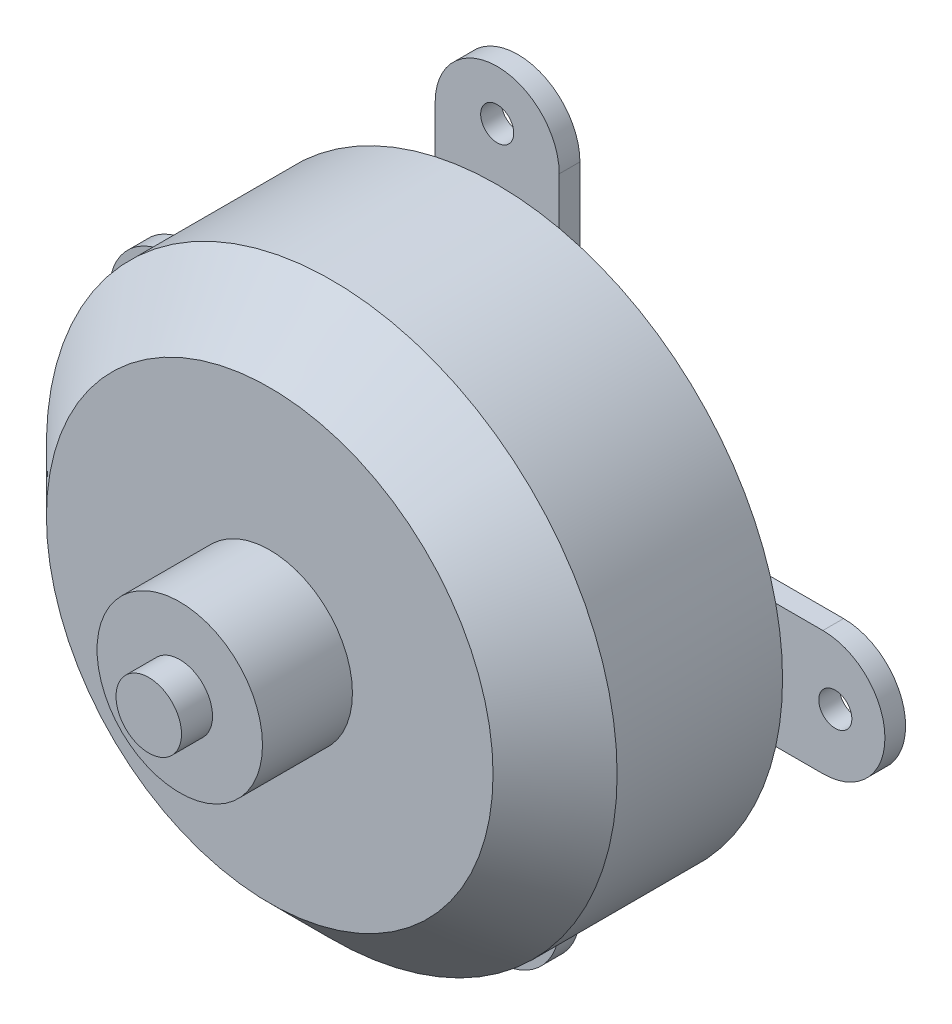
ISO-10303-21;
HEADER;
FILE_DESCRIPTION(('STEP AP214'),'2;1');
FILE_NAME('part.step','',(''),(''),'','','');
FILE_SCHEMA(('AUTOMOTIVE_DESIGN { 1 0 10303 214 1 1 1 1 }'));
ENDSEC;
DATA;
#1=APPLICATION_CONTEXT('core data for automotive mechanical design processes');
#2=APPLICATION_PROTOCOL_DEFINITION('international standard','automotive_design',2000,#1);
#3=PRODUCT_CONTEXT('',#1,'mechanical');
#4=PRODUCT('Part','Part','',(#3));
#5=PRODUCT_RELATED_PRODUCT_CATEGORY('part','',(#4));
#6=PRODUCT_DEFINITION_FORMATION('','',#4);
#7=PRODUCT_DEFINITION_CONTEXT('part definition',#1,'design');
#8=PRODUCT_DEFINITION('design','',#6,#7);
#9=PRODUCT_DEFINITION_SHAPE('','',#8);
#10=(LENGTH_UNIT() NAMED_UNIT(*) SI_UNIT(.MILLI.,.METRE.));
#11=(NAMED_UNIT(*) PLANE_ANGLE_UNIT() SI_UNIT($,.RADIAN.));
#12=(NAMED_UNIT(*) SI_UNIT($,.STERADIAN.) SOLID_ANGLE_UNIT());
#13=UNCERTAINTY_MEASURE_WITH_UNIT(LENGTH_MEASURE(1.E-05),#10,'distance_accuracy_value','');
#14=(GEOMETRIC_REPRESENTATION_CONTEXT(3) GLOBAL_UNCERTAINTY_ASSIGNED_CONTEXT((#13)) GLOBAL_UNIT_ASSIGNED_CONTEXT((#10,
#11,#12)) REPRESENTATION_CONTEXT('',''));
#15=CARTESIAN_POINT('',(0.,0.,0.));
#16=DIRECTION('',(0.,0.,1.));
#17=DIRECTION('',(1.,0.,0.));
#18=AXIS2_PLACEMENT_3D('',#15,#16,#17);
#19=CARTESIAN_POINT('',(-41.6387437653,8.21187680793408,16.35));
#20=DIRECTION('',(0.,0.,1.));
#21=DIRECTION('',(1.,0.,0.));
#22=AXIS2_PLACEMENT_3D('',#19,#20,#21);
#23=PLANE('',#22);
#24=CARTESIAN_POINT('',(-41.6387437653,8.21187680793408,16.35));
#25=DIRECTION('',(0.,0.,1.));
#26=DIRECTION('',(1.,0.,0.));
#27=AXIS2_PLACEMENT_3D('',#24,#25,#26);
#28=CIRCLE('',#27,4.00000000000001);
#29=CARTESIAN_POINT('',(-37.6387437653,8.21187680793408,16.35));
#30=VERTEX_POINT('',#29);
#31=EDGE_CURVE('E191',#30,#30,#28,.T.);
#32=ORIENTED_EDGE('',*,*,#31,.T.);
#33=EDGE_LOOP('',(#32));
#34=FACE_BOUND('',#33,.T.);
#35=CARTESIAN_POINT('',(-41.6387437653,8.21187680793408,16.35));
#36=DIRECTION('',(0.,0.,1.));
#37=DIRECTION('',(1.,0.,0.));
#38=AXIS2_PLACEMENT_3D('',#35,#36,#37);
#39=CIRCLE('',#38,1.58345957302733);
#40=CARTESIAN_POINT('',(-40.0552841922727,8.21187680793408,16.35));
#41=VERTEX_POINT('',#40);
#42=EDGE_CURVE('E201',#41,#41,#39,.T.);
#43=ORIENTED_EDGE('',*,*,#42,.F.);
#44=EDGE_LOOP('',(#43));
#45=FACE_BOUND('',#44,.T.);
#46=ADVANCED_FACE('F34',(#34,#45),#23,.T.);
#47=CARTESIAN_POINT('',(-41.6387437653,8.21187680793408,12.));
#48=DIRECTION('',(0.,0.,1.));
#49=DIRECTION('',(1.,0.,0.));
#50=AXIS2_PLACEMENT_3D('',#47,#48,#49);
#51=PLANE('',#50);
#52=CARTESIAN_POINT('',(-41.6387437653,8.21187680793408,12.));
#53=DIRECTION('',(0.,0.,1.));
#54=DIRECTION('',(1.,0.,0.));
#55=AXIS2_PLACEMENT_3D('',#52,#53,#54);
#56=CIRCLE('',#55,10.8);
#57=CARTESIAN_POINT('',(-30.8387437653,8.21187680793408,12.));
#58=VERTEX_POINT('',#57);
#59=EDGE_CURVE('E42',#58,#58,#56,.T.);
#60=ORIENTED_EDGE('',*,*,#59,.T.);
#61=EDGE_LOOP('',(#60));
#62=FACE_BOUND('',#61,.T.);
#63=CARTESIAN_POINT('',(-41.6387437653,8.21187680793408,12.));
#64=DIRECTION('',(0.,0.,1.));
#65=DIRECTION('',(1.,0.,0.));
#66=AXIS2_PLACEMENT_3D('',#63,#64,#65);
#67=CIRCLE('',#66,4.00000000000001);
#68=CARTESIAN_POINT('',(-37.6387437653,8.21187680793408,12.));
#69=VERTEX_POINT('',#68);
#70=EDGE_CURVE('E194',#69,#69,#67,.T.);
#71=ORIENTED_EDGE('',*,*,#70,.F.);
#72=EDGE_LOOP('',(#71));
#73=FACE_BOUND('',#72,.T.);
#74=ADVANCED_FACE('F217',(#62,#73),#51,.T.);
#75=CARTESIAN_POINT('',(-38.6387437653,23.9618768079341,1.));
#76=DIRECTION('',(0.,0.,1.));
#77=DIRECTION('',(1.,0.,0.));
#78=AXIS2_PLACEMENT_3D('',#75,#76,#77);
#79=PLANE('',#78);
#80=CARTESIAN_POINT('',(-41.6387437653,8.21187680793408,1.));
#81=DIRECTION('',(0.,0.,1.));
#82=DIRECTION('',(1.,0.,0.));
#83=AXIS2_PLACEMENT_3D('',#80,#81,#82);
#84=CIRCLE('',#83,13.8);
#85=CARTESIAN_POINT('',(-38.6387437653,21.6818434003203,1.));
#86=VERTEX_POINT('',#85);
#87=CARTESIAN_POINT('',(-44.6387437653,21.6818434003203,1.));
#88=VERTEX_POINT('',#87);
#89=EDGE_CURVE('E56',#86,#88,#84,.T.);
#90=ORIENTED_EDGE('',*,*,#89,.F.);
#91=DIRECTION('',(0.,1.,0.));
#92=VECTOR('',#91,1.);
#93=CARTESIAN_POINT('',(-38.6387437653,11.2118768079341,1.));
#94=LINE('',#93,#92);
#95=CARTESIAN_POINT('',(-38.6387437653,23.9618768079341,1.));
#96=VERTEX_POINT('',#95);
#97=EDGE_CURVE('E158',#86,#96,#94,.T.);
#98=ORIENTED_EDGE('',*,*,#97,.T.);
#99=CARTESIAN_POINT('',(-41.6387437653,23.9618768079341,1.));
#100=DIRECTION('',(0.,0.,1.));
#101=DIRECTION('',(1.,0.,0.));
#102=AXIS2_PLACEMENT_3D('',#99,#100,#101);
#103=CIRCLE('',#102,3.);
#104=CARTESIAN_POINT('',(-44.6387437653,23.9618768079341,1.));
#105=VERTEX_POINT('',#104);
#106=EDGE_CURVE('E421',#96,#105,#103,.T.);
#107=ORIENTED_EDGE('',*,*,#106,.T.);
#108=DIRECTION('',(0.,-1.,0.));
#109=VECTOR('',#108,1.);
#110=CARTESIAN_POINT('',(-44.6387437653,23.9618768079341,1.));
#111=LINE('',#110,#109);
#112=EDGE_CURVE('E429',#105,#88,#111,.T.);
#113=ORIENTED_EDGE('',*,*,#112,.T.);
#114=EDGE_LOOP('',(#90,#98,#107,#113));
#115=FACE_BOUND('',#114,.T.);
#116=CARTESIAN_POINT('',(-41.6387437653,24.5618768079341,1.));
#117=DIRECTION('',(0.,0.,1.));
#118=DIRECTION('',(1.,0.,0.));
#119=AXIS2_PLACEMENT_3D('',#116,#117,#118);
#120=CIRCLE('',#119,0.799999999999988);
#121=CARTESIAN_POINT('',(-40.8387437653,24.5618768079341,1.));
#122=VERTEX_POINT('',#121);
#123=EDGE_CURVE('E183',#122,#122,#120,.T.);
#124=ORIENTED_EDGE('',*,*,#123,.F.);
#125=EDGE_LOOP('',(#124));
#126=FACE_BOUND('',#125,.T.);
#127=ADVANCED_FACE('F222',(#115,#126),#79,.T.);
#128=CARTESIAN_POINT('',(-55.1087103576862,11.2118768079341,1.));
#129=VERTEX_POINT('',#128);
#130=CARTESIAN_POINT('',(-55.1087103576862,5.21187680793408,1.));
#131=VERTEX_POINT('',#130);
#132=EDGE_CURVE('E390',#129,#131,#84,.T.);
#133=ORIENTED_EDGE('',*,*,#132,.F.);
#134=DIRECTION('',(-1.,0.,0.));
#135=VECTOR('',#134,1.);
#136=CARTESIAN_POINT('',(-44.6387437653,11.2118768079341,1.));
#137=LINE('',#136,#135);
#138=CARTESIAN_POINT('',(-57.3887437653,11.2118768079341,1.));
#139=VERTEX_POINT('',#138);
#140=EDGE_CURVE('E430',#129,#139,#137,.T.);
#141=ORIENTED_EDGE('',*,*,#140,.T.);
#142=CARTESIAN_POINT('',(-57.3887437653,8.21187680793408,1.));
#143=DIRECTION('',(0.,0.,1.));
#144=DIRECTION('',(1.,0.,0.));
#145=AXIS2_PLACEMENT_3D('',#142,#143,#144);
#146=CIRCLE('',#145,3.);
#147=CARTESIAN_POINT('',(-57.3887437653,5.21187680793408,1.));
#148=VERTEX_POINT('',#147);
#149=EDGE_CURVE('E377',#139,#148,#146,.T.);
#150=ORIENTED_EDGE('',*,*,#149,.T.);
#151=DIRECTION('',(1.,0.,0.));
#152=VECTOR('',#151,1.);
#153=CARTESIAN_POINT('',(-57.3887437653,5.21187680793408,1.));
#154=LINE('',#153,#152);
#155=EDGE_CURVE('E406',#148,#131,#154,.T.);
#156=ORIENTED_EDGE('',*,*,#155,.T.);
#157=EDGE_LOOP('',(#133,#141,#150,#156));
#158=FACE_BOUND('',#157,.T.);
#159=CARTESIAN_POINT('',(-57.9887437653,8.21187680793408,1.));
#160=DIRECTION('',(0.,0.,1.));
#161=DIRECTION('',(1.,0.,0.));
#162=AXIS2_PLACEMENT_3D('',#159,#160,#161);
#163=CIRCLE('',#162,0.799999999999988);
#164=CARTESIAN_POINT('',(-57.1887437653,8.21187680793408,1.));
#165=VERTEX_POINT('',#164);
#166=EDGE_CURVE('E378',#165,#165,#163,.T.);
#167=ORIENTED_EDGE('',*,*,#166,.F.);
#168=EDGE_LOOP('',(#167));
#169=FACE_BOUND('',#168,.T.);
#170=ADVANCED_FACE('F308',(#158,#169),#79,.T.);
#171=CARTESIAN_POINT('',(-44.6387437653,-5.25808978445211,1.));
#172=VERTEX_POINT('',#171);
#173=CARTESIAN_POINT('',(-38.6387437653,-5.25808978445211,1.));
#174=VERTEX_POINT('',#173);
#175=EDGE_CURVE('E178',#172,#174,#84,.T.);
#176=ORIENTED_EDGE('',*,*,#175,.F.);
#177=DIRECTION('',(0.,-1.,0.));
#178=VECTOR('',#177,1.);
#179=CARTESIAN_POINT('',(-44.6387437653,5.21187680793408,1.));
#180=LINE('',#179,#178);
#181=CARTESIAN_POINT('',(-44.6387437653,-7.53812319206592,1.));
#182=VERTEX_POINT('',#181);
#183=EDGE_CURVE('E397',#172,#182,#180,.T.);
#184=ORIENTED_EDGE('',*,*,#183,.T.);
#185=CARTESIAN_POINT('',(-41.6387437653,-7.53812319206592,1.));
#186=DIRECTION('',(0.,0.,1.));
#187=DIRECTION('',(1.,0.,0.));
#188=AXIS2_PLACEMENT_3D('',#185,#186,#187);
#189=CIRCLE('',#188,3.);
#190=CARTESIAN_POINT('',(-38.6387437653,-7.53812319206592,1.));
#191=VERTEX_POINT('',#190);
#192=EDGE_CURVE('E440',#182,#191,#189,.T.);
#193=ORIENTED_EDGE('',*,*,#192,.T.);
#194=DIRECTION('',(0.,1.,0.));
#195=VECTOR('',#194,1.);
#196=CARTESIAN_POINT('',(-38.6387437653,-7.53812319206592,1.));
#197=LINE('',#196,#195);
#198=EDGE_CURVE('E400',#191,#174,#197,.T.);
#199=ORIENTED_EDGE('',*,*,#198,.T.);
#200=EDGE_LOOP('',(#176,#184,#193,#199));
#201=FACE_BOUND('',#200,.T.);
#202=CARTESIAN_POINT('',(-41.6387437653,-8.13812319206592,1.));
#203=DIRECTION('',(0.,0.,1.));
#204=DIRECTION('',(1.,0.,0.));
#205=AXIS2_PLACEMENT_3D('',#202,#203,#204);
#206=CIRCLE('',#205,0.799999999999988);
#207=CARTESIAN_POINT('',(-40.8387437653,-8.13812319206592,1.));
#208=VERTEX_POINT('',#207);
#209=EDGE_CURVE('E382',#208,#208,#206,.T.);
#210=ORIENTED_EDGE('',*,*,#209,.F.);
#211=EDGE_LOOP('',(#210));
#212=FACE_BOUND('',#211,.T.);
#213=ADVANCED_FACE('F275',(#201,#212),#79,.T.);
#214=CARTESIAN_POINT('',(-44.6387437653,23.9618768079341,1.));
#215=DIRECTION('',(1.,0.,0.));
#216=DIRECTION('',(0.,0.,-1.));
#217=AXIS2_PLACEMENT_3D('',#214,#215,#216);
#218=PLANE('',#217);
#219=DIRECTION('',(0.,-1.,0.));
#220=VECTOR('',#219,1.);
#221=CARTESIAN_POINT('',(-44.6387437653,23.9618768079341,0.));
#222=LINE('',#221,#220);
#223=CARTESIAN_POINT('',(-44.6387437653,23.9618768079341,0.));
#224=VERTEX_POINT('',#223);
#225=CARTESIAN_POINT('',(-44.6387437653,11.2118768079341,0.));
#226=VERTEX_POINT('',#225);
#227=EDGE_CURVE('E311',#224,#226,#222,.T.);
#228=ORIENTED_EDGE('',*,*,#227,.T.);
#229=DIRECTION('',(0.,0.,-1.));
#230=VECTOR('',#229,1.);
#231=CARTESIAN_POINT('',(-44.6387437653,11.2118768079341,1.));
#232=LINE('',#231,#230);
#233=CARTESIAN_POINT('',(-44.6387437653,11.2118768079341,1.));
#234=VERTEX_POINT('',#233);
#235=EDGE_CURVE('E313',#234,#226,#232,.T.);
#236=ORIENTED_EDGE('',*,*,#235,.F.);
#237=EDGE_CURVE('E49',#88,#234,#111,.T.);
#238=ORIENTED_EDGE('',*,*,#237,.F.);
#239=ORIENTED_EDGE('',*,*,#112,.F.);
#240=DIRECTION('',(0.,0.,-1.));
#241=VECTOR('',#240,1.);
#242=CARTESIAN_POINT('',(-44.6387437653,23.9618768079341,1.));
#243=LINE('',#242,#241);
#244=EDGE_CURVE('E179',#105,#224,#243,.T.);
#245=ORIENTED_EDGE('',*,*,#244,.T.);
#246=EDGE_LOOP('',(#228,#236,#238,#239,#245));
#247=FACE_BOUND('',#246,.T.);
#248=ADVANCED_FACE('F302',(#247),#218,.F.);
#249=CARTESIAN_POINT('',(-44.6387437653,11.2118768079341,1.));
#250=DIRECTION('',(0.,-1.,0.));
#251=DIRECTION('',(1.,0.,0.));
#252=AXIS2_PLACEMENT_3D('',#249,#250,#251);
#253=PLANE('',#252);
#254=DIRECTION('',(-1.,0.,0.));
#255=VECTOR('',#254,1.);
#256=CARTESIAN_POINT('',(-44.6387437653,11.2118768079341,0.));
#257=LINE('',#256,#255);
#258=CARTESIAN_POINT('',(-57.3887437653,11.2118768079341,0.));
#259=VERTEX_POINT('',#258);
#260=EDGE_CURVE('E320',#226,#259,#257,.T.);
#261=ORIENTED_EDGE('',*,*,#260,.T.);
#262=DIRECTION('',(0.,0.,-1.));
#263=VECTOR('',#262,1.);
#264=CARTESIAN_POINT('',(-57.3887437653,11.2118768079341,1.));
#265=LINE('',#264,#263);
#266=EDGE_CURVE('E328',#139,#259,#265,.T.);
#267=ORIENTED_EDGE('',*,*,#266,.F.);
#268=ORIENTED_EDGE('',*,*,#140,.F.);
#269=EDGE_CURVE('E327',#234,#129,#137,.T.);
#270=ORIENTED_EDGE('',*,*,#269,.F.);
#271=ORIENTED_EDGE('',*,*,#235,.T.);
#272=EDGE_LOOP('',(#261,#267,#268,#270,#271));
#273=FACE_BOUND('',#272,.T.);
#274=ADVANCED_FACE('F299',(#273),#253,.F.);
#275=CARTESIAN_POINT('',(-57.3887437653,5.21187680793408,1.));
#276=DIRECTION('',(0.,1.,0.));
#277=DIRECTION('',(-1.,0.,0.));
#278=AXIS2_PLACEMENT_3D('',#275,#276,#277);
#279=PLANE('',#278);
#280=DIRECTION('',(1.,0.,0.));
#281=VECTOR('',#280,1.);
#282=CARTESIAN_POINT('',(-57.3887437653,5.21187680793408,0.));
#283=LINE('',#282,#281);
#284=CARTESIAN_POINT('',(-57.3887437653,5.21187680793408,0.));
#285=VERTEX_POINT('',#284);
#286=CARTESIAN_POINT('',(-44.6387437653,5.21187680793408,0.));
#287=VERTEX_POINT('',#286);
#288=EDGE_CURVE('E333',#285,#287,#283,.T.);
#289=ORIENTED_EDGE('',*,*,#288,.T.);
#290=DIRECTION('',(0.,0.,-1.));
#291=VECTOR('',#290,1.);
#292=CARTESIAN_POINT('',(-44.6387437653,5.21187680793408,1.));
#293=LINE('',#292,#291);
#294=CARTESIAN_POINT('',(-44.6387437653,5.21187680793408,1.));
#295=VERTEX_POINT('',#294);
#296=EDGE_CURVE('E366',#295,#287,#293,.T.);
#297=ORIENTED_EDGE('',*,*,#296,.F.);
#298=EDGE_CURVE('E408',#131,#295,#154,.T.);
#299=ORIENTED_EDGE('',*,*,#298,.F.);
#300=ORIENTED_EDGE('',*,*,#155,.F.);
#301=DIRECTION('',(0.,0.,-1.));
#302=VECTOR('',#301,1.);
#303=CARTESIAN_POINT('',(-57.3887437653,5.21187680793408,1.));
#304=LINE('',#303,#302);
#305=EDGE_CURVE('E369',#148,#285,#304,.T.);
#306=ORIENTED_EDGE('',*,*,#305,.T.);
#307=EDGE_LOOP('',(#289,#297,#299,#300,#306));
#308=FACE_BOUND('',#307,.T.);
#309=ADVANCED_FACE('F295',(#308),#279,.F.);
#310=CARTESIAN_POINT('',(-44.6387437653,5.21187680793408,1.));
#311=DIRECTION('',(1.,0.,0.));
#312=DIRECTION('',(0.,0.,-1.));
#313=AXIS2_PLACEMENT_3D('',#310,#311,#312);
#314=PLANE('',#313);
#315=DIRECTION('',(0.,-1.,0.));
#316=VECTOR('',#315,1.);
#317=CARTESIAN_POINT('',(-44.6387437653,5.21187680793408,0.));
#318=LINE('',#317,#316);
#319=CARTESIAN_POINT('',(-44.6387437653,-7.53812319206592,0.));
#320=VERTEX_POINT('',#319);
#321=EDGE_CURVE('E335',#287,#320,#318,.T.);
#322=ORIENTED_EDGE('',*,*,#321,.T.);
#323=DIRECTION('',(0.,0.,-1.));
#324=VECTOR('',#323,1.);
#325=CARTESIAN_POINT('',(-44.6387437653,-7.53812319206592,1.));
#326=LINE('',#325,#324);
#327=EDGE_CURVE('E364',#182,#320,#326,.T.);
#328=ORIENTED_EDGE('',*,*,#327,.F.);
#329=ORIENTED_EDGE('',*,*,#183,.F.);
#330=EDGE_CURVE('E404',#295,#172,#180,.T.);
#331=ORIENTED_EDGE('',*,*,#330,.F.);
#332=ORIENTED_EDGE('',*,*,#296,.T.);
#333=EDGE_LOOP('',(#322,#328,#329,#331,#332));
#334=FACE_BOUND('',#333,.T.);
#335=ADVANCED_FACE('F291',(#334),#314,.F.);
#336=CARTESIAN_POINT('',(-38.6387437653,-7.53812319206592,1.));
#337=DIRECTION('',(-1.,0.,0.));
#338=DIRECTION('',(0.,0.,1.));
#339=AXIS2_PLACEMENT_3D('',#336,#337,#338);
#340=PLANE('',#339);
#341=DIRECTION('',(0.,1.,0.));
#342=VECTOR('',#341,1.);
#343=CARTESIAN_POINT('',(-38.6387437653,-7.53812319206592,0.));
#344=LINE('',#343,#342);
#345=CARTESIAN_POINT('',(-38.6387437653,-7.53812319206592,0.));
#346=VERTEX_POINT('',#345);
#347=CARTESIAN_POINT('',(-38.6387437653,5.21187680793408,0.));
#348=VERTEX_POINT('',#347);
#349=EDGE_CURVE('E341',#346,#348,#344,.T.);
#350=ORIENTED_EDGE('',*,*,#349,.T.);
#351=DIRECTION('',(0.,0.,-1.));
#352=VECTOR('',#351,1.);
#353=CARTESIAN_POINT('',(-38.6387437653,5.21187680793408,1.));
#354=LINE('',#353,#352);
#355=CARTESIAN_POINT('',(-38.6387437653,5.21187680793408,1.));
#356=VERTEX_POINT('',#355);
#357=EDGE_CURVE('E358',#356,#348,#354,.T.);
#358=ORIENTED_EDGE('',*,*,#357,.F.);
#359=EDGE_CURVE('E409',#174,#356,#197,.T.);
#360=ORIENTED_EDGE('',*,*,#359,.F.);
#361=ORIENTED_EDGE('',*,*,#198,.F.);
#362=DIRECTION('',(0.,0.,-1.));
#363=VECTOR('',#362,1.);
#364=CARTESIAN_POINT('',(-38.6387437653,-7.53812319206592,1.));
#365=LINE('',#364,#363);
#366=EDGE_CURVE('E361',#191,#346,#365,.T.);
#367=ORIENTED_EDGE('',*,*,#366,.T.);
#368=EDGE_LOOP('',(#350,#358,#360,#361,#367));
#369=FACE_BOUND('',#368,.T.);
#370=ADVANCED_FACE('F287',(#369),#340,.F.);
#371=CARTESIAN_POINT('',(-38.6387437653,5.21187680793408,1.));
#372=DIRECTION('',(0.,1.,0.));
#373=DIRECTION('',(0.,0.,1.));
#374=AXIS2_PLACEMENT_3D('',#371,#372,#373);
#375=PLANE('',#374);
#376=DIRECTION('',(1.,0.,0.));
#377=VECTOR('',#376,1.);
#378=CARTESIAN_POINT('',(-38.6387437653,5.21187680793408,0.));
#379=LINE('',#378,#377);
#380=CARTESIAN_POINT('',(-25.8887437653,5.21187680793408,0.));
#381=VERTEX_POINT('',#380);
#382=EDGE_CURVE('E343',#348,#381,#379,.T.);
#383=ORIENTED_EDGE('',*,*,#382,.T.);
#384=DIRECTION('',(0.,0.,-1.));
#385=VECTOR('',#384,1.);
#386=CARTESIAN_POINT('',(-25.8887437653,5.21187680793408,1.));
#387=LINE('',#386,#385);
#388=CARTESIAN_POINT('',(-25.8887437653,5.21187680793408,1.));
#389=VERTEX_POINT('',#388);
#390=EDGE_CURVE('E356',#389,#381,#387,.T.);
#391=ORIENTED_EDGE('',*,*,#390,.F.);
#392=DIRECTION('',(1.,0.,0.));
#393=VECTOR('',#392,1.);
#394=CARTESIAN_POINT('',(-38.6387437653,5.21187680793408,1.));
#395=LINE('',#394,#393);
#396=CARTESIAN_POINT('',(-28.1687771729138,5.21187680793408,1.));
#397=VERTEX_POINT('',#396);
#398=EDGE_CURVE('E415',#397,#389,#395,.T.);
#399=ORIENTED_EDGE('',*,*,#398,.F.);
#400=EDGE_CURVE('E169',#356,#397,#395,.T.);
#401=ORIENTED_EDGE('',*,*,#400,.F.);
#402=ORIENTED_EDGE('',*,*,#357,.T.);
#403=EDGE_LOOP('',(#383,#391,#399,#401,#402));
#404=FACE_BOUND('',#403,.T.);
#405=ADVANCED_FACE('F284',(#404),#375,.F.);
#406=CARTESIAN_POINT('',(-38.6387437653,11.2118768079341,1.));
#407=DIRECTION('',(0.,-1.,0.));
#408=DIRECTION('',(0.,0.,-1.));
#409=AXIS2_PLACEMENT_3D('',#406,#407,#408);
#410=PLANE('',#409);
#411=DIRECTION('',(-1.,0.,0.));
#412=VECTOR('',#411,1.);
#413=CARTESIAN_POINT('',(-38.6387437653,11.2118768079341,0.));
#414=LINE('',#413,#412);
#415=CARTESIAN_POINT('',(-25.8887437653,11.2118768079341,0.));
#416=VERTEX_POINT('',#415);
#417=CARTESIAN_POINT('',(-38.6387437653,11.2118768079341,0.));
#418=VERTEX_POINT('',#417);
#419=EDGE_CURVE('E346',#416,#418,#414,.T.);
#420=ORIENTED_EDGE('',*,*,#419,.T.);
#421=DIRECTION('',(0.,0.,-1.));
#422=VECTOR('',#421,1.);
#423=CARTESIAN_POINT('',(-38.6387437653,11.2118768079341,1.));
#424=LINE('',#423,#422);
#425=CARTESIAN_POINT('',(-38.6387437653,11.2118768079341,1.));
#426=VERTEX_POINT('',#425);
#427=EDGE_CURVE('E164',#426,#418,#424,.T.);
#428=ORIENTED_EDGE('',*,*,#427,.F.);
#429=DIRECTION('',(-1.,0.,0.));
#430=VECTOR('',#429,1.);
#431=CARTESIAN_POINT('',(-38.6387437653,11.2118768079341,1.));
#432=LINE('',#431,#430);
#433=CARTESIAN_POINT('',(-28.1687771729138,11.2118768079341,1.));
#434=VERTEX_POINT('',#433);
#435=EDGE_CURVE('E159',#434,#426,#432,.T.);
#436=ORIENTED_EDGE('',*,*,#435,.F.);
#437=CARTESIAN_POINT('',(-25.8887437653,11.2118768079341,1.));
#438=VERTEX_POINT('',#437);
#439=EDGE_CURVE('E147',#438,#434,#432,.T.);
#440=ORIENTED_EDGE('',*,*,#439,.F.);
#441=DIRECTION('',(0.,0.,-1.));
#442=VECTOR('',#441,1.);
#443=CARTESIAN_POINT('',(-25.8887437653,11.2118768079341,1.));
#444=LINE('',#443,#442);
#445=EDGE_CURVE('E354',#438,#416,#444,.T.);
#446=ORIENTED_EDGE('',*,*,#445,.T.);
#447=EDGE_LOOP('',(#420,#428,#436,#440,#446));
#448=FACE_BOUND('',#447,.T.);
#449=ADVANCED_FACE('F162',(#448),#410,.F.);
#450=CARTESIAN_POINT('',(-38.6387437653,11.2118768079341,1.));
#451=DIRECTION('',(-1.,0.,0.));
#452=DIRECTION('',(0.,0.,1.));
#453=AXIS2_PLACEMENT_3D('',#450,#451,#452);
#454=PLANE('',#453);
#455=DIRECTION('',(0.,1.,0.));
#456=VECTOR('',#455,1.);
#457=CARTESIAN_POINT('',(-38.6387437653,11.2118768079341,0.));
#458=LINE('',#457,#456);
#459=CARTESIAN_POINT('',(-38.6387437653,23.9618768079341,0.));
#460=VERTEX_POINT('',#459);
#461=EDGE_CURVE('E348',#418,#460,#458,.T.);
#462=ORIENTED_EDGE('',*,*,#461,.T.);
#463=DIRECTION('',(0.,0.,-1.));
#464=VECTOR('',#463,1.);
#465=CARTESIAN_POINT('',(-38.6387437653,23.9618768079341,1.));
#466=LINE('',#465,#464);
#467=EDGE_CURVE('E350',#96,#460,#466,.T.);
#468=ORIENTED_EDGE('',*,*,#467,.F.);
#469=ORIENTED_EDGE('',*,*,#97,.F.);
#470=EDGE_CURVE('E182',#426,#86,#94,.T.);
#471=ORIENTED_EDGE('',*,*,#470,.F.);
#472=ORIENTED_EDGE('',*,*,#427,.T.);
#473=EDGE_LOOP('',(#462,#468,#469,#471,#472));
#474=FACE_BOUND('',#473,.T.);
#475=ADVANCED_FACE('F274',(#474),#454,.F.);
#476=EDGE_CURVE('E152',#397,#434,#84,.T.);
#477=ORIENTED_EDGE('',*,*,#476,.F.);
#478=ORIENTED_EDGE('',*,*,#398,.T.);
#479=CARTESIAN_POINT('',(-25.8887437653,8.21187680793408,1.));
#480=DIRECTION('',(0.,0.,1.));
#481=DIRECTION('',(1.,0.,0.));
#482=AXIS2_PLACEMENT_3D('',#479,#480,#481);
#483=CIRCLE('',#482,3.);
#484=EDGE_CURVE('E155',#389,#438,#483,.T.);
#485=ORIENTED_EDGE('',*,*,#484,.T.);
#486=ORIENTED_EDGE('',*,*,#439,.T.);
#487=EDGE_LOOP('',(#477,#478,#485,#486));
#488=FACE_BOUND('',#487,.T.);
#489=CARTESIAN_POINT('',(-25.2887437653,8.21187680793408,1.));
#490=DIRECTION('',(0.,0.,1.));
#491=DIRECTION('',(1.,0.,0.));
#492=AXIS2_PLACEMENT_3D('',#489,#490,#491);
#493=CIRCLE('',#492,0.799999999999988);
#494=CARTESIAN_POINT('',(-24.4887437653,8.21187680793408,1.));
#495=VERTEX_POINT('',#494);
#496=EDGE_CURVE('E386',#495,#495,#493,.T.);
#497=ORIENTED_EDGE('',*,*,#496,.F.);
#498=EDGE_LOOP('',(#497));
#499=FACE_BOUND('',#498,.T.);
#500=ADVANCED_FACE('F149',(#488,#499),#79,.T.);
#501=CARTESIAN_POINT('',(-38.6387437653,23.9618768079341,0.));
#502=DIRECTION('',(0.,0.,1.));
#503=DIRECTION('',(1.,0.,0.));
#504=AXIS2_PLACEMENT_3D('',#501,#502,#503);
#505=PLANE('',#504);
#506=CARTESIAN_POINT('',(-41.6387437653,24.5618768079341,0.));
#507=DIRECTION('',(0.,0.,1.));
#508=DIRECTION('',(1.,0.,0.));
#509=AXIS2_PLACEMENT_3D('',#506,#507,#508);
#510=CIRCLE('',#509,0.799999999999988);
#511=CARTESIAN_POINT('',(-40.8387437653,24.5618768079341,0.));
#512=VERTEX_POINT('',#511);
#513=EDGE_CURVE('E186',#512,#512,#510,.T.);
#514=ORIENTED_EDGE('',*,*,#513,.T.);
#515=EDGE_LOOP('',(#514));
#516=FACE_BOUND('',#515,.T.);
#517=CARTESIAN_POINT('',(-25.2887437653,8.21187680793408,0.));
#518=DIRECTION('',(0.,0.,1.));
#519=DIRECTION('',(1.,0.,0.));
#520=AXIS2_PLACEMENT_3D('',#517,#518,#519);
#521=CIRCLE('',#520,0.799999999999988);
#522=CARTESIAN_POINT('',(-24.4887437653,8.21187680793408,0.));
#523=VERTEX_POINT('',#522);
#524=EDGE_CURVE('E383',#523,#523,#521,.T.);
#525=ORIENTED_EDGE('',*,*,#524,.T.);
#526=EDGE_LOOP('',(#525));
#527=FACE_BOUND('',#526,.T.);
#528=CARTESIAN_POINT('',(-41.6387437653,-8.13812319206592,0.));
#529=DIRECTION('',(0.,0.,1.));
#530=DIRECTION('',(1.,0.,0.));
#531=AXIS2_PLACEMENT_3D('',#528,#529,#530);
#532=CIRCLE('',#531,0.799999999999988);
#533=CARTESIAN_POINT('',(-40.8387437653,-8.13812319206592,0.));
#534=VERTEX_POINT('',#533);
#535=EDGE_CURVE('E379',#534,#534,#532,.T.);
#536=ORIENTED_EDGE('',*,*,#535,.T.);
#537=EDGE_LOOP('',(#536));
#538=FACE_BOUND('',#537,.T.);
#539=CARTESIAN_POINT('',(-57.9887437653,8.21187680793408,0.));
#540=DIRECTION('',(0.,0.,1.));
#541=DIRECTION('',(1.,0.,0.));
#542=AXIS2_PLACEMENT_3D('',#539,#540,#541);
#543=CIRCLE('',#542,0.799999999999988);
#544=CARTESIAN_POINT('',(-57.1887437653,8.21187680793408,0.));
#545=VERTEX_POINT('',#544);
#546=EDGE_CURVE('E374',#545,#545,#543,.T.);
#547=ORIENTED_EDGE('',*,*,#546,.T.);
#548=EDGE_LOOP('',(#547));
#549=FACE_BOUND('',#548,.T.);
#550=ORIENTED_EDGE('',*,*,#288,.F.);
#551=CARTESIAN_POINT('',(-57.3887437653,8.21187680793408,0.));
#552=DIRECTION('',(0.,0.,1.));
#553=DIRECTION('',(1.,0.,0.));
#554=AXIS2_PLACEMENT_3D('',#551,#552,#553);
#555=CIRCLE('',#554,3.);
#556=EDGE_CURVE('E332',#259,#285,#555,.T.);
#557=ORIENTED_EDGE('',*,*,#556,.F.);
#558=ORIENTED_EDGE('',*,*,#260,.F.);
#559=ORIENTED_EDGE('',*,*,#227,.F.);
#560=CARTESIAN_POINT('',(-41.6387437653,23.9618768079341,0.));
#561=DIRECTION('',(0.,0.,1.));
#562=DIRECTION('',(1.,0.,0.));
#563=AXIS2_PLACEMENT_3D('',#560,#561,#562);
#564=CIRCLE('',#563,3.);
#565=EDGE_CURVE('E321',#460,#224,#564,.T.);
#566=ORIENTED_EDGE('',*,*,#565,.F.);
#567=ORIENTED_EDGE('',*,*,#461,.F.);
#568=ORIENTED_EDGE('',*,*,#419,.F.);
#569=CARTESIAN_POINT('',(-25.8887437653,8.21187680793408,0.));
#570=DIRECTION('',(0.,0.,1.));
#571=DIRECTION('',(1.,0.,0.));
#572=AXIS2_PLACEMENT_3D('',#569,#570,#571);
#573=CIRCLE('',#572,3.);
#574=EDGE_CURVE('E423',#381,#416,#573,.T.);
#575=ORIENTED_EDGE('',*,*,#574,.F.);
#576=ORIENTED_EDGE('',*,*,#382,.F.);
#577=ORIENTED_EDGE('',*,*,#349,.F.);
#578=CARTESIAN_POINT('',(-41.6387437653,-7.53812319206592,0.));
#579=DIRECTION('',(0.,0.,1.));
#580=DIRECTION('',(1.,0.,0.));
#581=AXIS2_PLACEMENT_3D('',#578,#579,#580);
#582=CIRCLE('',#581,3.);
#583=EDGE_CURVE('E444',#320,#346,#582,.T.);
#584=ORIENTED_EDGE('',*,*,#583,.F.);
#585=ORIENTED_EDGE('',*,*,#321,.F.);
#586=EDGE_LOOP('',(#550,#557,#558,#559,#566,#567,#568,#575,#576,#577,#584,#585));
#587=FACE_BOUND('',#586,.T.);
#588=ADVANCED_FACE('F270',(#516,#527,#538,#549,#587),#505,.F.);
#589=CARTESIAN_POINT('',(-41.6387437653,23.9618768079341,0.));
#590=DIRECTION('',(0.,0.,1.));
#591=DIRECTION('',(1.,0.,0.));
#592=AXIS2_PLACEMENT_3D('',#589,#590,#591);
#593=CYLINDRICAL_SURFACE('',#592,3.);
#594=ORIENTED_EDGE('',*,*,#565,.T.);
#595=ORIENTED_EDGE('',*,*,#244,.F.);
#596=ORIENTED_EDGE('',*,*,#106,.F.);
#597=ORIENTED_EDGE('',*,*,#467,.T.);
#598=EDGE_LOOP('',(#594,#595,#596,#597));
#599=FACE_BOUND('',#598,.T.);
#600=ADVANCED_FACE('F266',(#599),#593,.T.);
#601=CARTESIAN_POINT('',(-25.8887437653,8.21187680793408,0.));
#602=DIRECTION('',(0.,0.,1.));
#603=DIRECTION('',(1.,0.,0.));
#604=AXIS2_PLACEMENT_3D('',#601,#602,#603);
#605=CYLINDRICAL_SURFACE('',#604,3.);
#606=ORIENTED_EDGE('',*,*,#390,.T.);
#607=ORIENTED_EDGE('',*,*,#574,.T.);
#608=ORIENTED_EDGE('',*,*,#445,.F.);
#609=ORIENTED_EDGE('',*,*,#484,.F.);
#610=EDGE_LOOP('',(#606,#607,#608,#609));
#611=FACE_BOUND('',#610,.T.);
#612=ADVANCED_FACE('F262',(#611),#605,.T.);
#613=CARTESIAN_POINT('',(-41.6387437653,-7.53812319206592,0.));
#614=DIRECTION('',(0.,0.,1.));
#615=DIRECTION('',(1.,0.,0.));
#616=AXIS2_PLACEMENT_3D('',#613,#614,#615);
#617=CYLINDRICAL_SURFACE('',#616,3.);
#618=ORIENTED_EDGE('',*,*,#327,.T.);
#619=ORIENTED_EDGE('',*,*,#583,.T.);
#620=ORIENTED_EDGE('',*,*,#366,.F.);
#621=ORIENTED_EDGE('',*,*,#192,.F.);
#622=EDGE_LOOP('',(#618,#619,#620,#621));
#623=FACE_BOUND('',#622,.T.);
#624=ADVANCED_FACE('F258',(#623),#617,.T.);
#625=CARTESIAN_POINT('',(-57.3887437653,8.21187680793408,0.));
#626=DIRECTION('',(0.,0.,1.));
#627=DIRECTION('',(1.,0.,0.));
#628=AXIS2_PLACEMENT_3D('',#625,#626,#627);
#629=CYLINDRICAL_SURFACE('',#628,3.);
#630=ORIENTED_EDGE('',*,*,#266,.T.);
#631=ORIENTED_EDGE('',*,*,#556,.T.);
#632=ORIENTED_EDGE('',*,*,#305,.F.);
#633=ORIENTED_EDGE('',*,*,#149,.F.);
#634=EDGE_LOOP('',(#630,#631,#632,#633));
#635=FACE_BOUND('',#634,.T.);
#636=ADVANCED_FACE('F254',(#635),#629,.T.);
#637=CARTESIAN_POINT('',(-57.9887437653,8.21187680793408,1.));
#638=DIRECTION('',(0.,0.,1.));
#639=DIRECTION('',(1.,0.,0.));
#640=AXIS2_PLACEMENT_3D('',#637,#638,#639);
#641=CYLINDRICAL_SURFACE('',#640,0.799999999999988);
#642=ORIENTED_EDGE('',*,*,#166,.T.);
#643=EDGE_LOOP('',(#642));
#644=FACE_BOUND('',#643,.T.);
#645=ORIENTED_EDGE('',*,*,#546,.F.);
#646=EDGE_LOOP('',(#645));
#647=FACE_BOUND('',#646,.T.);
#648=ADVANCED_FACE('F250',(#644,#647),#641,.F.);
#649=CARTESIAN_POINT('',(-41.6387437653,-8.13812319206592,1.));
#650=DIRECTION('',(0.,0.,1.));
#651=DIRECTION('',(1.,0.,0.));
#652=AXIS2_PLACEMENT_3D('',#649,#650,#651);
#653=CYLINDRICAL_SURFACE('',#652,0.799999999999988);
#654=ORIENTED_EDGE('',*,*,#209,.T.);
#655=EDGE_LOOP('',(#654));
#656=FACE_BOUND('',#655,.T.);
#657=ORIENTED_EDGE('',*,*,#535,.F.);
#658=EDGE_LOOP('',(#657));
#659=FACE_BOUND('',#658,.T.);
#660=ADVANCED_FACE('F246',(#656,#659),#653,.F.);
#661=CARTESIAN_POINT('',(-25.2887437653,8.21187680793408,1.));
#662=DIRECTION('',(0.,0.,1.));
#663=DIRECTION('',(1.,0.,0.));
#664=AXIS2_PLACEMENT_3D('',#661,#662,#663);
#665=CYLINDRICAL_SURFACE('',#664,0.799999999999988);
#666=ORIENTED_EDGE('',*,*,#496,.T.);
#667=EDGE_LOOP('',(#666));
#668=FACE_BOUND('',#667,.T.);
#669=ORIENTED_EDGE('',*,*,#524,.F.);
#670=EDGE_LOOP('',(#669));
#671=FACE_BOUND('',#670,.T.);
#672=ADVANCED_FACE('F242',(#668,#671),#665,.F.);
#673=CARTESIAN_POINT('',(-41.6387437653,24.5618768079341,1.));
#674=DIRECTION('',(0.,0.,1.));
#675=DIRECTION('',(1.,0.,0.));
#676=AXIS2_PLACEMENT_3D('',#673,#674,#675);
#677=CYLINDRICAL_SURFACE('',#676,0.799999999999988);
#678=ORIENTED_EDGE('',*,*,#123,.T.);
#679=EDGE_LOOP('',(#678));
#680=FACE_BOUND('',#679,.T.);
#681=ORIENTED_EDGE('',*,*,#513,.F.);
#682=EDGE_LOOP('',(#681));
#683=FACE_BOUND('',#682,.T.);
#684=ADVANCED_FACE('F234',(#680,#683),#677,.F.);
#685=CARTESIAN_POINT('',(-41.6387437653,8.21187680793408,1.));
#686=DIRECTION('',(0.,0.,1.));
#687=DIRECTION('',(1.,0.,0.));
#688=AXIS2_PLACEMENT_3D('',#685,#686,#687);
#689=PLANE('',#688);
#690=EDGE_CURVE('E189',#131,#172,#84,.T.);
#691=ORIENTED_EDGE('',*,*,#690,.F.);
#692=ORIENTED_EDGE('',*,*,#298,.T.);
#693=ORIENTED_EDGE('',*,*,#330,.T.);
#694=EDGE_LOOP('',(#691,#692,#693));
#695=FACE_BOUND('',#694,.T.);
#696=ADVANCED_FACE('F230',(#695),#689,.F.);
#697=EDGE_CURVE('E177',#174,#397,#84,.T.);
#698=ORIENTED_EDGE('',*,*,#697,.F.);
#699=ORIENTED_EDGE('',*,*,#359,.T.);
#700=ORIENTED_EDGE('',*,*,#400,.T.);
#701=EDGE_LOOP('',(#698,#699,#700));
#702=FACE_BOUND('',#701,.T.);
#703=ADVANCED_FACE('F233',(#702),#689,.F.);
#704=EDGE_CURVE('E174',#434,#86,#84,.T.);
#705=ORIENTED_EDGE('',*,*,#704,.F.);
#706=ORIENTED_EDGE('',*,*,#435,.T.);
#707=ORIENTED_EDGE('',*,*,#470,.T.);
#708=EDGE_LOOP('',(#705,#706,#707));
#709=FACE_BOUND('',#708,.T.);
#710=ADVANCED_FACE('F181',(#709),#689,.F.);
#711=ORIENTED_EDGE('',*,*,#237,.T.);
#712=ORIENTED_EDGE('',*,*,#269,.T.);
#713=EDGE_CURVE('E184',#88,#129,#84,.T.);
#714=ORIENTED_EDGE('',*,*,#713,.F.);
#715=EDGE_LOOP('',(#711,#712,#714));
#716=FACE_BOUND('',#715,.T.);
#717=ADVANCED_FACE('F236',(#716),#689,.F.);
#718=CARTESIAN_POINT('',(-41.6387437653,8.21187680793408,12.));
#719=DIRECTION('',(0.,0.,-1.));
#720=DIRECTION('',(-1.,0.,0.));
#721=AXIS2_PLACEMENT_3D('',#718,#719,#720);
#722=CYLINDRICAL_SURFACE('',#721,13.8);
#723=CARTESIAN_POINT('',(-41.6387437653,8.21187680793408,8.99999999999998));
#724=DIRECTION('',(0.,0.,1.));
#725=DIRECTION('',(1.,0.,0.));
#726=AXIS2_PLACEMENT_3D('',#723,#724,#725);
#727=CIRCLE('',#726,13.8);
#728=CARTESIAN_POINT('',(-27.8387437653,8.21187680793408,8.99999999999998));
#729=VERTEX_POINT('',#728);
#730=EDGE_CURVE('E11',#729,#729,#727,.F.);
#731=ORIENTED_EDGE('',*,*,#730,.T.);
#732=EDGE_LOOP('',(#731));
#733=FACE_BOUND('',#732,.T.);
#734=ORIENTED_EDGE('',*,*,#704,.T.);
#735=ORIENTED_EDGE('',*,*,#89,.T.);
#736=ORIENTED_EDGE('',*,*,#713,.T.);
#737=ORIENTED_EDGE('',*,*,#132,.T.);
#738=ORIENTED_EDGE('',*,*,#690,.T.);
#739=ORIENTED_EDGE('',*,*,#175,.T.);
#740=ORIENTED_EDGE('',*,*,#697,.T.);
#741=ORIENTED_EDGE('',*,*,#476,.T.);
#742=EDGE_LOOP('',(#734,#735,#736,#737,#738,#739,#740,#741));
#743=FACE_BOUND('',#742,.T.);
#744=ADVANCED_FACE('F173',(#733,#743),#722,.T.);
#745=CARTESIAN_POINT('',(-41.6387437653,8.21187680793408,12.));
#746=DIRECTION('',(0.,0.,-1.));
#747=DIRECTION('',(-1.,0.,0.));
#748=AXIS2_PLACEMENT_3D('',#745,#746,#747);
#749=CONICAL_SURFACE('',#748,10.8,0.785398163397445);
#750=ORIENTED_EDGE('',*,*,#730,.F.);
#751=EDGE_LOOP('',(#750));
#752=FACE_BOUND('',#751,.T.);
#753=ORIENTED_EDGE('',*,*,#59,.F.);
#754=EDGE_LOOP('',(#753));
#755=FACE_BOUND('',#754,.T.);
#756=ADVANCED_FACE('F36',(#752,#755),#749,.T.);
#757=CARTESIAN_POINT('',(-41.6387437653,8.21187680793408,16.35));
#758=DIRECTION('',(0.,0.,-1.));
#759=DIRECTION('',(-1.,0.,0.));
#760=AXIS2_PLACEMENT_3D('',#757,#758,#759);
#761=CYLINDRICAL_SURFACE('',#760,4.00000000000001);
#762=ORIENTED_EDGE('',*,*,#31,.F.);
#763=EDGE_LOOP('',(#762));
#764=FACE_BOUND('',#763,.T.);
#765=ORIENTED_EDGE('',*,*,#70,.T.);
#766=EDGE_LOOP('',(#765));
#767=FACE_BOUND('',#766,.T.);
#768=ADVANCED_FACE('F212',(#764,#767),#761,.T.);
#769=CARTESIAN_POINT('',(-41.6387437653,8.21187680793408,17.85));
#770=DIRECTION('',(0.,0.,-1.));
#771=DIRECTION('',(-1.,0.,0.));
#772=AXIS2_PLACEMENT_3D('',#769,#770,#771);
#773=CYLINDRICAL_SURFACE('',#772,1.58345957302733);
#774=CARTESIAN_POINT('',(-41.6387437653,8.21187680793408,17.85));
#775=DIRECTION('',(0.,0.,1.));
#776=DIRECTION('',(1.,0.,0.));
#777=AXIS2_PLACEMENT_3D('',#774,#775,#776);
#778=CIRCLE('',#777,1.58345957302733);
#779=CARTESIAN_POINT('',(-40.0552841922727,8.21187680793408,17.85));
#780=VERTEX_POINT('',#779);
#781=EDGE_CURVE('E199',#780,#780,#778,.T.);
#782=ORIENTED_EDGE('',*,*,#781,.F.);
#783=EDGE_LOOP('',(#782));
#784=FACE_BOUND('',#783,.T.);
#785=ORIENTED_EDGE('',*,*,#42,.T.);
#786=EDGE_LOOP('',(#785));
#787=FACE_BOUND('',#786,.T.);
#788=ADVANCED_FACE('F209',(#784,#787),#773,.T.);
#789=CARTESIAN_POINT('',(-41.6387437653,8.21187680793408,17.85));
#790=DIRECTION('',(0.,0.,1.));
#791=DIRECTION('',(1.,0.,0.));
#792=AXIS2_PLACEMENT_3D('',#789,#790,#791);
#793=PLANE('',#792);
#794=ORIENTED_EDGE('',*,*,#781,.T.);
#795=EDGE_LOOP('',(#794));
#796=FACE_BOUND('',#795,.T.);
#797=ADVANCED_FACE('F207',(#796),#793,.T.);
#798=CLOSED_SHELL('',(#46,#74,#127,#170,#213,#248,#274,#309,#335,#370,#405,#449,#475,#500,#588,
#600,#612,#624,#636,#648,#660,#672,#684,#696,#703,#710,#717,#744,#756,#768,#788,#797));
#799=MANIFOLD_SOLID_BREP('B2',#798);
#800=ADVANCED_BREP_SHAPE_REPRESENTATION('',(#18,#799),#14);
#801=SHAPE_DEFINITION_REPRESENTATION(#9,#800);
ENDSEC;
END-ISO-10303-21;
